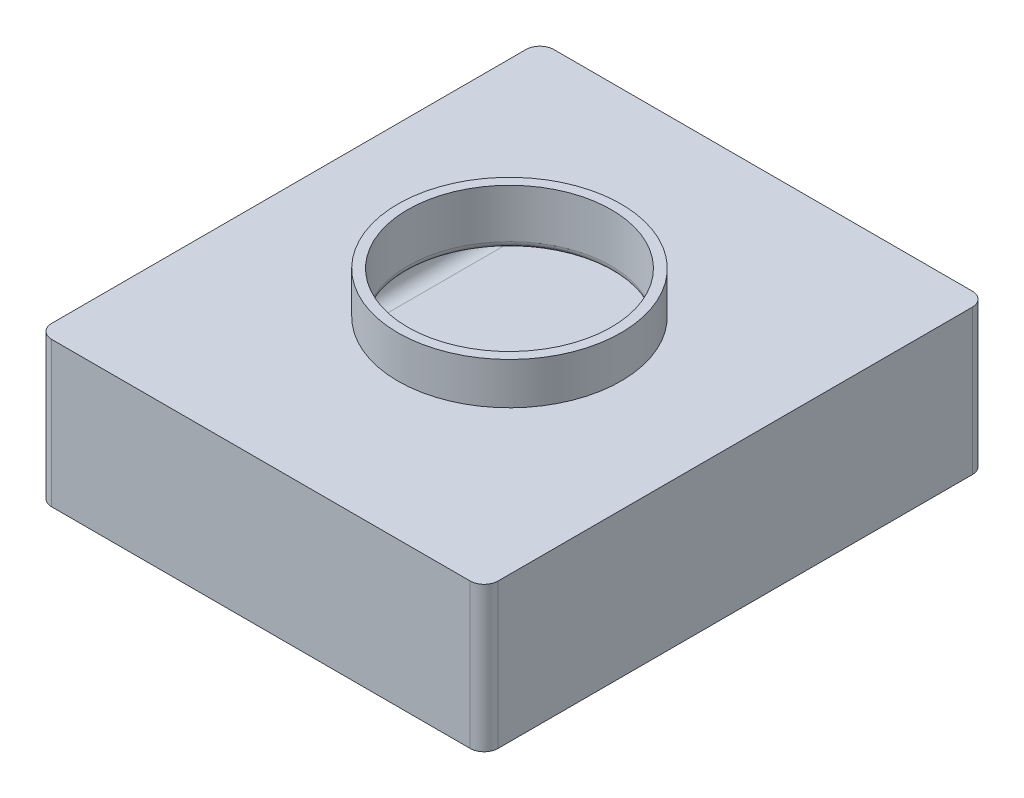
ISO-10303-21;
HEADER;
FILE_DESCRIPTION(('STEP AP214'),'2;1');
FILE_NAME('part.step','',(''),(''),'','','');
FILE_SCHEMA(('AUTOMOTIVE_DESIGN { 1 0 10303 214 1 1 1 1 }'));
ENDSEC;
DATA;
#1=APPLICATION_CONTEXT('core data for automotive mechanical design processes');
#2=APPLICATION_PROTOCOL_DEFINITION('international standard','automotive_design',2000,#1);
#3=PRODUCT_CONTEXT('',#1,'mechanical');
#4=PRODUCT('Part','Part','',(#3));
#5=PRODUCT_RELATED_PRODUCT_CATEGORY('part','',(#4));
#6=PRODUCT_DEFINITION_FORMATION('','',#4);
#7=PRODUCT_DEFINITION_CONTEXT('part definition',#1,'design');
#8=PRODUCT_DEFINITION('design','',#6,#7);
#9=PRODUCT_DEFINITION_SHAPE('','',#8);
#10=(LENGTH_UNIT() NAMED_UNIT(*) SI_UNIT(.MILLI.,.METRE.));
#11=(NAMED_UNIT(*) PLANE_ANGLE_UNIT() SI_UNIT($,.RADIAN.));
#12=(NAMED_UNIT(*) SI_UNIT($,.STERADIAN.) SOLID_ANGLE_UNIT());
#13=UNCERTAINTY_MEASURE_WITH_UNIT(LENGTH_MEASURE(1.E-05),#10,'distance_accuracy_value','');
#14=(GEOMETRIC_REPRESENTATION_CONTEXT(3) GLOBAL_UNCERTAINTY_ASSIGNED_CONTEXT((#13)) GLOBAL_UNIT_ASSIGNED_CONTEXT((#10,
#11,#12)) REPRESENTATION_CONTEXT('',''));
#15=CARTESIAN_POINT('',(0.,0.,0.));
#16=DIRECTION('',(0.,0.,1.));
#17=DIRECTION('',(1.,0.,0.));
#18=AXIS2_PLACEMENT_3D('',#15,#16,#17);
#19=CARTESIAN_POINT('',(-54.4628463476071,-6.351,-14.70612001765));
#20=DIRECTION('',(0.,1.,0.));
#21=DIRECTION('',(0.,0.,1.));
#22=AXIS2_PLACEMENT_3D('',#19,#20,#21);
#23=CYLINDRICAL_SURFACE('',#22,46.355);
#24=CARTESIAN_POINT('',(-54.4628463476071,56.515,-14.70612001765));
#25=DIRECTION('',(0.,1.,0.));
#26=DIRECTION('',(0.,0.,1.));
#27=AXIS2_PLACEMENT_3D('',#24,#25,#26);
#28=CIRCLE('',#27,46.355);
#29=CARTESIAN_POINT('',(-54.4628463476071,56.515,31.64887998235));
#30=VERTEX_POINT('',#29);
#31=EDGE_CURVE('E44',#30,#30,#28,.F.);
#32=ORIENTED_EDGE('',*,*,#31,.T.);
#33=EDGE_LOOP('',(#32));
#34=FACE_BOUND('',#33,.T.);
#35=CARTESIAN_POINT('',(-54.4628463476071,78.74,-14.70612001765));
#36=DIRECTION('',(0.,1.,0.));
#37=DIRECTION('',(0.,0.,1.));
#38=AXIS2_PLACEMENT_3D('',#35,#36,#37);
#39=CIRCLE('',#38,46.355);
#40=CARTESIAN_POINT('',(-54.4628463476071,78.74,31.64887998235));
#41=VERTEX_POINT('',#40);
#42=EDGE_CURVE('E822',#41,#41,#39,.T.);
#43=ORIENTED_EDGE('',*,*,#42,.T.);
#44=EDGE_LOOP('',(#43));
#45=FACE_BOUND('',#44,.T.);
#46=ADVANCED_FACE('F36',(#34,#45),#23,.F.);
#47=CARTESIAN_POINT('',(0.,0.,0.));
#48=DIRECTION('',(0.,-1.,0.));
#49=DIRECTION('',(0.,0.,-1.));
#50=AXIS2_PLACEMENT_3D('',#47,#48,#49);
#51=PLANE('',#50);
#52=DIRECTION('',(0.,0.,-1.));
#53=VECTOR('',#52,1.);
#54=CARTESIAN_POINT('',(34.4371536523929,0.,0.));
#55=LINE('',#54,#53);
#56=CARTESIAN_POINT('',(34.4371536523929,0.,85.7471161395949));
#57=VERTEX_POINT('',#56);
#58=CARTESIAN_POINT('',(34.4371536523929,0.,-117.452883860405));
#59=VERTEX_POINT('',#58);
#60=EDGE_CURVE('E270',#57,#59,#55,.T.);
#61=ORIENTED_EDGE('',*,*,#60,.T.);
#62=DIRECTION('',(-1.,0.,0.));
#63=VECTOR('',#62,1.);
#64=CARTESIAN_POINT('',(0.,0.,-117.452883860405));
#65=LINE('',#64,#63);
#66=CARTESIAN_POINT('',(-143.362846347607,0.,-117.452883860405));
#67=VERTEX_POINT('',#66);
#68=EDGE_CURVE('E276',#59,#67,#65,.T.);
#69=ORIENTED_EDGE('',*,*,#68,.T.);
#70=DIRECTION('',(0.,0.,1.));
#71=VECTOR('',#70,1.);
#72=CARTESIAN_POINT('',(-143.362846347607,0.,0.));
#73=LINE('',#72,#71);
#74=CARTESIAN_POINT('',(-143.362846347607,0.,85.7471161395949));
#75=VERTEX_POINT('',#74);
#76=EDGE_CURVE('E274',#67,#75,#73,.T.);
#77=ORIENTED_EDGE('',*,*,#76,.T.);
#78=DIRECTION('',(1.,0.,0.));
#79=VECTOR('',#78,1.);
#80=CARTESIAN_POINT('',(0.,0.,85.7471161395949));
#81=LINE('',#80,#79);
#82=EDGE_CURVE('E272',#75,#57,#81,.T.);
#83=ORIENTED_EDGE('',*,*,#82,.T.);
#84=EDGE_LOOP('',(#61,#69,#77,#83));
#85=FACE_BOUND('',#84,.T.);
#86=ADVANCED_FACE('F368',(#85),#51,.F.);
#87=CARTESIAN_POINT('',(40.7871536523929,53.34,-123.802883860405));
#88=DIRECTION('',(-1.,0.,0.));
#89=DIRECTION('',(0.,0.,1.));
#90=AXIS2_PLACEMENT_3D('',#87,#88,#89);
#91=PLANE('',#90);
#92=DIRECTION('',(0.,0.,-1.));
#93=VECTOR('',#92,1.);
#94=CARTESIAN_POINT('',(40.7871536523929,6.35,-123.802883860405));
#95=LINE('',#94,#93);
#96=CARTESIAN_POINT('',(40.7871536523929,6.35,-117.452883860405));
#97=VERTEX_POINT('',#96);
#98=CARTESIAN_POINT('',(40.7871536523929,6.35,85.7471161395949));
#99=VERTEX_POINT('',#98);
#100=EDGE_CURVE('E252',#97,#99,#95,.F.);
#101=ORIENTED_EDGE('',*,*,#100,.T.);
#102=DIRECTION('',(0.,-1.,0.));
#103=VECTOR('',#102,1.);
#104=CARTESIAN_POINT('',(40.7871536523929,53.34,85.7471161395949));
#105=LINE('',#104,#103);
#106=CARTESIAN_POINT('',(40.7871536523929,46.99,85.7471161395949));
#107=VERTEX_POINT('',#106);
#108=EDGE_CURVE('E258',#99,#107,#105,.F.);
#109=ORIENTED_EDGE('',*,*,#108,.T.);
#110=DIRECTION('',(0.,0.,-1.));
#111=VECTOR('',#110,1.);
#112=CARTESIAN_POINT('',(40.7871536523929,46.99,-123.802883860405));
#113=LINE('',#112,#111);
#114=CARTESIAN_POINT('',(40.7871536523929,46.99,-117.452883860405));
#115=VERTEX_POINT('',#114);
#116=EDGE_CURVE('E256',#107,#115,#113,.T.);
#117=ORIENTED_EDGE('',*,*,#116,.T.);
#118=DIRECTION('',(0.,-1.,0.));
#119=VECTOR('',#118,1.);
#120=CARTESIAN_POINT('',(40.7871536523929,0.,-117.452883860405));
#121=LINE('',#120,#119);
#122=EDGE_CURVE('E254',#115,#97,#121,.T.);
#123=ORIENTED_EDGE('',*,*,#122,.T.);
#124=EDGE_LOOP('',(#101,#109,#117,#123));
#125=FACE_BOUND('',#124,.T.);
#126=ADVANCED_FACE('F373',(#125),#91,.T.);
#127=CARTESIAN_POINT('',(-149.712846347607,53.34,-123.802883860405));
#128=DIRECTION('',(0.,0.,1.));
#129=DIRECTION('',(1.,0.,0.));
#130=AXIS2_PLACEMENT_3D('',#127,#128,#129);
#131=PLANE('',#130);
#132=DIRECTION('',(-1.,0.,0.));
#133=VECTOR('',#132,1.);
#134=CARTESIAN_POINT('',(-149.712846347607,6.35,-123.802883860405));
#135=LINE('',#134,#133);
#136=CARTESIAN_POINT('',(-143.362846347607,6.35,-123.802883860405));
#137=VERTEX_POINT('',#136);
#138=CARTESIAN_POINT('',(34.4371536523929,6.35,-123.802883860405));
#139=VERTEX_POINT('',#138);
#140=EDGE_CURVE('E263',#137,#139,#135,.F.);
#141=ORIENTED_EDGE('',*,*,#140,.T.);
#142=DIRECTION('',(0.,-1.,0.));
#143=VECTOR('',#142,1.);
#144=CARTESIAN_POINT('',(34.4371536523929,53.34,-123.802883860405));
#145=LINE('',#144,#143);
#146=CARTESIAN_POINT('',(34.4371536523929,46.99,-123.802883860405));
#147=VERTEX_POINT('',#146);
#148=EDGE_CURVE('E267',#139,#147,#145,.F.);
#149=ORIENTED_EDGE('',*,*,#148,.T.);
#150=DIRECTION('',(-1.,0.,0.));
#151=VECTOR('',#150,1.);
#152=CARTESIAN_POINT('',(-149.712846347607,46.99,-123.802883860405));
#153=LINE('',#152,#151);
#154=CARTESIAN_POINT('',(-143.362846347607,46.99,-123.802883860405));
#155=VERTEX_POINT('',#154);
#156=EDGE_CURVE('E265',#147,#155,#153,.T.);
#157=ORIENTED_EDGE('',*,*,#156,.T.);
#158=DIRECTION('',(0.,-1.,0.));
#159=VECTOR('',#158,1.);
#160=CARTESIAN_POINT('',(-143.362846347607,0.,-123.802883860405));
#161=LINE('',#160,#159);
#162=EDGE_CURVE('E261',#155,#137,#161,.T.);
#163=ORIENTED_EDGE('',*,*,#162,.T.);
#164=EDGE_LOOP('',(#141,#149,#157,#163));
#165=FACE_BOUND('',#164,.T.);
#166=ADVANCED_FACE('F389',(#165),#131,.T.);
#167=CARTESIAN_POINT('',(-149.712846347607,53.34,-123.802883860405));
#168=DIRECTION('',(1.,0.,0.));
#169=DIRECTION('',(0.,0.,-1.));
#170=AXIS2_PLACEMENT_3D('',#167,#168,#169);
#171=PLANE('',#170);
#172=DIRECTION('',(0.,0.,1.));
#173=VECTOR('',#172,1.);
#174=CARTESIAN_POINT('',(-149.712846347607,46.99,-123.802883860405));
#175=LINE('',#174,#173);
#176=CARTESIAN_POINT('',(-149.712846347607,46.99,-117.452883860405));
#177=VERTEX_POINT('',#176);
#178=CARTESIAN_POINT('',(-149.712846347607,46.99,85.7471161395949));
#179=VERTEX_POINT('',#178);
#180=EDGE_CURVE('E283',#177,#179,#175,.T.);
#181=ORIENTED_EDGE('',*,*,#180,.T.);
#182=DIRECTION('',(0.,-1.,0.));
#183=VECTOR('',#182,1.);
#184=CARTESIAN_POINT('',(-149.712846347607,0.,85.7471161395949));
#185=LINE('',#184,#183);
#186=CARTESIAN_POINT('',(-149.712846347607,6.35,85.7471161395949));
#187=VERTEX_POINT('',#186);
#188=EDGE_CURVE('E59',#179,#187,#185,.T.);
#189=ORIENTED_EDGE('',*,*,#188,.T.);
#190=DIRECTION('',(0.,0.,1.));
#191=VECTOR('',#190,1.);
#192=CARTESIAN_POINT('',(-149.712846347607,6.35,-123.802883860405));
#193=LINE('',#192,#191);
#194=CARTESIAN_POINT('',(-149.712846347607,6.35,-117.452883860405));
#195=VERTEX_POINT('',#194);
#196=EDGE_CURVE('E281',#187,#195,#193,.F.);
#197=ORIENTED_EDGE('',*,*,#196,.T.);
#198=DIRECTION('',(0.,-1.,0.));
#199=VECTOR('',#198,1.);
#200=CARTESIAN_POINT('',(-149.712846347607,53.34,-117.452883860405));
#201=LINE('',#200,#199);
#202=EDGE_CURVE('E279',#195,#177,#201,.F.);
#203=ORIENTED_EDGE('',*,*,#202,.T.);
#204=EDGE_LOOP('',(#181,#189,#197,#203));
#205=FACE_BOUND('',#204,.T.);
#206=ADVANCED_FACE('F392',(#205),#171,.T.);
#207=CARTESIAN_POINT('',(-149.712846347607,53.34,92.0971161395949));
#208=DIRECTION('',(0.,0.,-1.));
#209=DIRECTION('',(-1.,0.,0.));
#210=AXIS2_PLACEMENT_3D('',#207,#208,#209);
#211=PLANE('',#210);
#212=DIRECTION('',(0.,-1.,0.));
#213=VECTOR('',#212,1.);
#214=CARTESIAN_POINT('',(-143.362846347607,53.34,92.0971161395949));
#215=LINE('',#214,#213);
#216=CARTESIAN_POINT('',(-143.362846347607,6.35,92.0971161395949));
#217=VERTEX_POINT('',#216);
#218=CARTESIAN_POINT('',(-143.362846347607,46.99,92.0971161395949));
#219=VERTEX_POINT('',#218);
#220=EDGE_CURVE('E234',#217,#219,#215,.F.);
#221=ORIENTED_EDGE('',*,*,#220,.T.);
#222=DIRECTION('',(1.,0.,0.));
#223=VECTOR('',#222,1.);
#224=CARTESIAN_POINT('',(-149.712846347607,46.99,92.0971161395949));
#225=LINE('',#224,#223);
#226=CARTESIAN_POINT('',(34.4371536523929,46.99,92.0971161395949));
#227=VERTEX_POINT('',#226);
#228=EDGE_CURVE('E240',#219,#227,#225,.T.);
#229=ORIENTED_EDGE('',*,*,#228,.T.);
#230=DIRECTION('',(0.,-1.,0.));
#231=VECTOR('',#230,1.);
#232=CARTESIAN_POINT('',(34.4371536523929,0.,92.0971161395949));
#233=LINE('',#232,#231);
#234=CARTESIAN_POINT('',(34.4371536523929,6.35,92.0971161395949));
#235=VERTEX_POINT('',#234);
#236=EDGE_CURVE('E238',#227,#235,#233,.T.);
#237=ORIENTED_EDGE('',*,*,#236,.T.);
#238=DIRECTION('',(1.,0.,0.));
#239=VECTOR('',#238,1.);
#240=CARTESIAN_POINT('',(-149.712846347607,6.35,92.0971161395949));
#241=LINE('',#240,#239);
#242=EDGE_CURVE('E236',#235,#217,#241,.F.);
#243=ORIENTED_EDGE('',*,*,#242,.T.);
#244=EDGE_LOOP('',(#221,#229,#237,#243));
#245=FACE_BOUND('',#244,.T.);
#246=ADVANCED_FACE('F384',(#245),#211,.T.);
#247=CARTESIAN_POINT('',(0.,53.34,0.));
#248=DIRECTION('',(0.,1.,0.));
#249=DIRECTION('',(0.,0.,1.));
#250=AXIS2_PLACEMENT_3D('',#247,#248,#249);
#251=PLANE('',#250);
#252=CARTESIAN_POINT('',(-54.4628463476071,53.34,-14.70612001765));
#253=DIRECTION('',(0.,1.,0.));
#254=DIRECTION('',(0.,0.,1.));
#255=AXIS2_PLACEMENT_3D('',#252,#253,#254);
#256=CIRCLE('',#255,49.53);
#257=CARTESIAN_POINT('',(-54.4628463476071,53.34,34.82387998235));
#258=VERTEX_POINT('',#257);
#259=EDGE_CURVE('E11',#258,#258,#256,.T.);
#260=ORIENTED_EDGE('',*,*,#259,.T.);
#261=EDGE_LOOP('',(#260));
#262=FACE_BOUND('',#261,.T.);
#263=DIRECTION('',(0.,0.,-1.));
#264=VECTOR('',#263,1.);
#265=CARTESIAN_POINT('',(34.4371536523929,53.34,0.));
#266=LINE('',#265,#264);
#267=CARTESIAN_POINT('',(34.4371536523929,53.34,-117.452883860405));
#268=VERTEX_POINT('',#267);
#269=CARTESIAN_POINT('',(34.4371536523929,53.34,85.7471161395949));
#270=VERTEX_POINT('',#269);
#271=EDGE_CURVE('E247',#268,#270,#266,.F.);
#272=ORIENTED_EDGE('',*,*,#271,.T.);
#273=DIRECTION('',(1.,0.,0.));
#274=VECTOR('',#273,1.);
#275=CARTESIAN_POINT('',(0.,53.34,85.7471161395949));
#276=LINE('',#275,#274);
#277=CARTESIAN_POINT('',(-143.362846347607,53.34,85.7471161395949));
#278=VERTEX_POINT('',#277);
#279=EDGE_CURVE('E249',#270,#278,#276,.F.);
#280=ORIENTED_EDGE('',*,*,#279,.T.);
#281=DIRECTION('',(0.,0.,1.));
#282=VECTOR('',#281,1.);
#283=CARTESIAN_POINT('',(-143.362846347607,53.34,0.));
#284=LINE('',#283,#282);
#285=CARTESIAN_POINT('',(-143.362846347607,53.34,-117.452883860405));
#286=VERTEX_POINT('',#285);
#287=EDGE_CURVE('E243',#278,#286,#284,.F.);
#288=ORIENTED_EDGE('',*,*,#287,.T.);
#289=DIRECTION('',(-1.,0.,0.));
#290=VECTOR('',#289,1.);
#291=CARTESIAN_POINT('',(0.,53.34,-117.452883860405));
#292=LINE('',#291,#290);
#293=EDGE_CURVE('E245',#286,#268,#292,.F.);
#294=ORIENTED_EDGE('',*,*,#293,.T.);
#295=EDGE_LOOP('',(#272,#280,#288,#294));
#296=FACE_BOUND('',#295,.T.);
#297=ADVANCED_FACE('F380',(#262,#296),#251,.F.);
#298=CARTESIAN_POINT('',(0.,6.35,-117.452883860405));
#299=DIRECTION('',(-1.,0.,0.));
#300=DIRECTION('',(0.,0.,1.));
#301=AXIS2_PLACEMENT_3D('',#298,#299,#300);
#302=CYLINDRICAL_SURFACE('',#301,6.35);
#303=CARTESIAN_POINT('',(-143.362846347607,6.35,-117.452883860405));
#304=DIRECTION('',(1.,0.,0.));
#305=DIRECTION('',(0.,0.,-1.));
#306=AXIS2_PLACEMENT_3D('',#303,#304,#305);
#307=CIRCLE('',#306,6.35);
#308=EDGE_CURVE('E349',#67,#137,#307,.T.);
#309=ORIENTED_EDGE('',*,*,#308,.F.);
#310=ORIENTED_EDGE('',*,*,#68,.F.);
#311=CARTESIAN_POINT('',(34.4371536523929,6.35,-117.452883860405));
#312=DIRECTION('',(-1.,0.,0.));
#313=DIRECTION('',(0.,0.,1.));
#314=AXIS2_PLACEMENT_3D('',#311,#312,#313);
#315=CIRCLE('',#314,6.35);
#316=EDGE_CURVE('E346',#139,#59,#315,.T.);
#317=ORIENTED_EDGE('',*,*,#316,.F.);
#318=ORIENTED_EDGE('',*,*,#140,.F.);
#319=EDGE_LOOP('',(#309,#310,#317,#318));
#320=FACE_BOUND('',#319,.T.);
#321=ADVANCED_FACE('F383',(#320),#302,.F.);
#322=CARTESIAN_POINT('',(-143.362846347607,6.35,-117.452883860405));
#323=DIRECTION('',(0.,0.,1.));
#324=DIRECTION('',(1.,0.,0.));
#325=AXIS2_PLACEMENT_3D('',#322,#323,#324);
#326=SPHERICAL_SURFACE('',#325,6.35);
#327=CARTESIAN_POINT('',(-143.362846347607,6.35,-117.452883860405));
#328=DIRECTION('',(0.,0.,1.));
#329=DIRECTION('',(1.,0.,0.));
#330=AXIS2_PLACEMENT_3D('',#327,#328,#329);
#331=CIRCLE('',#330,6.35);
#332=EDGE_CURVE('E340',#67,#195,#331,.F.);
#333=ORIENTED_EDGE('',*,*,#332,.F.);
#334=ORIENTED_EDGE('',*,*,#308,.T.);
#335=CARTESIAN_POINT('',(-143.362846347607,6.35,-117.452883860405));
#336=DIRECTION('',(0.,1.,0.));
#337=DIRECTION('',(0.,0.,1.));
#338=AXIS2_PLACEMENT_3D('',#335,#336,#337);
#339=CIRCLE('',#338,6.35);
#340=EDGE_CURVE('E343',#195,#137,#339,.F.);
#341=ORIENTED_EDGE('',*,*,#340,.F.);
#342=EDGE_LOOP('',(#333,#334,#341));
#343=FACE_BOUND('',#342,.T.);
#344=ADVANCED_FACE('F499',(#343),#326,.F.);
#345=CARTESIAN_POINT('',(34.4371536523929,6.35,-117.452883860405));
#346=DIRECTION('',(0.,0.,1.));
#347=DIRECTION('',(1.,0.,0.));
#348=AXIS2_PLACEMENT_3D('',#345,#346,#347);
#349=SPHERICAL_SURFACE('',#348,6.35);
#350=CARTESIAN_POINT('',(34.4371536523929,6.35,-117.452883860405));
#351=DIRECTION('',(0.,1.,0.));
#352=DIRECTION('',(0.,0.,1.));
#353=AXIS2_PLACEMENT_3D('',#350,#351,#352);
#354=CIRCLE('',#353,6.35);
#355=EDGE_CURVE('E334',#139,#97,#354,.F.);
#356=ORIENTED_EDGE('',*,*,#355,.F.);
#357=ORIENTED_EDGE('',*,*,#316,.T.);
#358=CARTESIAN_POINT('',(34.4371536523929,6.35,-117.452883860405));
#359=DIRECTION('',(0.,0.,1.));
#360=DIRECTION('',(1.,0.,0.));
#361=AXIS2_PLACEMENT_3D('',#358,#359,#360);
#362=CIRCLE('',#361,6.35);
#363=EDGE_CURVE('E337',#97,#59,#362,.F.);
#364=ORIENTED_EDGE('',*,*,#363,.F.);
#365=EDGE_LOOP('',(#356,#357,#364));
#366=FACE_BOUND('',#365,.T.);
#367=ADVANCED_FACE('F495',(#366),#349,.F.);
#368=CARTESIAN_POINT('',(-143.362846347607,53.34,-117.452883860405));
#369=DIRECTION('',(0.,1.,0.));
#370=DIRECTION('',(0.,0.,1.));
#371=AXIS2_PLACEMENT_3D('',#368,#369,#370);
#372=CYLINDRICAL_SURFACE('',#371,6.35);
#373=ORIENTED_EDGE('',*,*,#340,.T.);
#374=ORIENTED_EDGE('',*,*,#162,.F.);
#375=CARTESIAN_POINT('',(-143.362846347607,46.99,-117.452883860405));
#376=DIRECTION('',(0.,-1.,0.));
#377=DIRECTION('',(0.,0.,-1.));
#378=AXIS2_PLACEMENT_3D('',#375,#376,#377);
#379=CIRCLE('',#378,6.35);
#380=EDGE_CURVE('E328',#177,#155,#379,.T.);
#381=ORIENTED_EDGE('',*,*,#380,.F.);
#382=ORIENTED_EDGE('',*,*,#202,.F.);
#383=EDGE_LOOP('',(#373,#374,#381,#382));
#384=FACE_BOUND('',#383,.T.);
#385=ADVANCED_FACE('F491',(#384),#372,.F.);
#386=CARTESIAN_POINT('',(-143.362846347607,6.35,0.));
#387=DIRECTION('',(0.,0.,1.));
#388=DIRECTION('',(1.,0.,0.));
#389=AXIS2_PLACEMENT_3D('',#386,#387,#388);
#390=CYLINDRICAL_SURFACE('',#389,6.35);
#391=ORIENTED_EDGE('',*,*,#332,.T.);
#392=ORIENTED_EDGE('',*,*,#196,.F.);
#393=CARTESIAN_POINT('',(-143.362846347607,6.35,85.7471161395949));
#394=DIRECTION('',(0.,0.,-1.));
#395=DIRECTION('',(-1.,0.,0.));
#396=AXIS2_PLACEMENT_3D('',#393,#394,#395);
#397=CIRCLE('',#396,6.35);
#398=EDGE_CURVE('E325',#75,#187,#397,.T.);
#399=ORIENTED_EDGE('',*,*,#398,.F.);
#400=ORIENTED_EDGE('',*,*,#76,.F.);
#401=EDGE_LOOP('',(#391,#392,#399,#400));
#402=FACE_BOUND('',#401,.T.);
#403=ADVANCED_FACE('F487',(#402),#390,.F.);
#404=CARTESIAN_POINT('',(0.,6.35,85.7471161395949));
#405=DIRECTION('',(1.,0.,0.));
#406=DIRECTION('',(0.,0.,-1.));
#407=AXIS2_PLACEMENT_3D('',#404,#405,#406);
#408=CYLINDRICAL_SURFACE('',#407,6.35);
#409=CARTESIAN_POINT('',(34.4371536523929,6.35,85.7471161395949));
#410=DIRECTION('',(-1.,0.,0.));
#411=DIRECTION('',(0.,0.,1.));
#412=AXIS2_PLACEMENT_3D('',#409,#410,#411);
#413=CIRCLE('',#412,6.35);
#414=EDGE_CURVE('E319',#57,#235,#413,.T.);
#415=ORIENTED_EDGE('',*,*,#414,.F.);
#416=ORIENTED_EDGE('',*,*,#82,.F.);
#417=CARTESIAN_POINT('',(-143.362846347607,6.35,85.7471161395949));
#418=DIRECTION('',(1.,0.,0.));
#419=DIRECTION('',(0.,0.,-1.));
#420=AXIS2_PLACEMENT_3D('',#417,#418,#419);
#421=CIRCLE('',#420,6.35);
#422=EDGE_CURVE('E322',#217,#75,#421,.T.);
#423=ORIENTED_EDGE('',*,*,#422,.F.);
#424=ORIENTED_EDGE('',*,*,#242,.F.);
#425=EDGE_LOOP('',(#415,#416,#423,#424));
#426=FACE_BOUND('',#425,.T.);
#427=ADVANCED_FACE('F483',(#426),#408,.F.);
#428=CARTESIAN_POINT('',(34.4371536523929,6.35,0.));
#429=DIRECTION('',(0.,0.,-1.));
#430=DIRECTION('',(-1.,0.,0.));
#431=AXIS2_PLACEMENT_3D('',#428,#429,#430);
#432=CYLINDRICAL_SURFACE('',#431,6.35);
#433=ORIENTED_EDGE('',*,*,#363,.T.);
#434=ORIENTED_EDGE('',*,*,#60,.F.);
#435=CARTESIAN_POINT('',(34.4371536523929,6.35,85.7471161395949));
#436=DIRECTION('',(0.,0.,-1.));
#437=DIRECTION('',(-1.,0.,0.));
#438=AXIS2_PLACEMENT_3D('',#435,#436,#437);
#439=CIRCLE('',#438,6.35);
#440=EDGE_CURVE('E316',#99,#57,#439,.T.);
#441=ORIENTED_EDGE('',*,*,#440,.F.);
#442=ORIENTED_EDGE('',*,*,#100,.F.);
#443=EDGE_LOOP('',(#433,#434,#441,#442));
#444=FACE_BOUND('',#443,.T.);
#445=ADVANCED_FACE('F479',(#444),#432,.F.);
#446=CARTESIAN_POINT('',(34.4371536523929,53.34,-117.452883860405));
#447=DIRECTION('',(0.,1.,0.));
#448=DIRECTION('',(0.,0.,1.));
#449=AXIS2_PLACEMENT_3D('',#446,#447,#448);
#450=CYLINDRICAL_SURFACE('',#449,6.35);
#451=ORIENTED_EDGE('',*,*,#355,.T.);
#452=ORIENTED_EDGE('',*,*,#122,.F.);
#453=CARTESIAN_POINT('',(34.4371536523929,46.99,-117.452883860405));
#454=DIRECTION('',(0.,-1.,0.));
#455=DIRECTION('',(0.,0.,-1.));
#456=AXIS2_PLACEMENT_3D('',#453,#454,#455);
#457=CIRCLE('',#456,6.35);
#458=EDGE_CURVE('E313',#147,#115,#457,.T.);
#459=ORIENTED_EDGE('',*,*,#458,.F.);
#460=ORIENTED_EDGE('',*,*,#148,.F.);
#461=EDGE_LOOP('',(#451,#452,#459,#460));
#462=FACE_BOUND('',#461,.T.);
#463=ADVANCED_FACE('F475',(#462),#450,.F.);
#464=CARTESIAN_POINT('',(-149.712846347607,46.99,-117.452883860405));
#465=DIRECTION('',(-1.,0.,0.));
#466=DIRECTION('',(0.,0.,1.));
#467=AXIS2_PLACEMENT_3D('',#464,#465,#466);
#468=CYLINDRICAL_SURFACE('',#467,6.35);
#469=CARTESIAN_POINT('',(-143.362846347607,46.99,-117.452883860405));
#470=DIRECTION('',(1.,0.,0.));
#471=DIRECTION('',(0.,0.,-1.));
#472=AXIS2_PLACEMENT_3D('',#469,#470,#471);
#473=CIRCLE('',#472,6.35);
#474=EDGE_CURVE('E331',#155,#286,#473,.T.);
#475=ORIENTED_EDGE('',*,*,#474,.F.);
#476=ORIENTED_EDGE('',*,*,#156,.F.);
#477=CARTESIAN_POINT('',(34.4371536523929,46.99,-117.452883860405));
#478=DIRECTION('',(-1.,0.,0.));
#479=DIRECTION('',(0.,0.,1.));
#480=AXIS2_PLACEMENT_3D('',#477,#478,#479);
#481=CIRCLE('',#480,6.35);
#482=EDGE_CURVE('E311',#268,#147,#481,.T.);
#483=ORIENTED_EDGE('',*,*,#482,.F.);
#484=ORIENTED_EDGE('',*,*,#293,.F.);
#485=EDGE_LOOP('',(#475,#476,#483,#484));
#486=FACE_BOUND('',#485,.T.);
#487=ADVANCED_FACE('F471',(#486),#468,.F.);
#488=CARTESIAN_POINT('',(-143.362846347607,46.99,-117.452883860405));
#489=DIRECTION('',(0.,0.,1.));
#490=DIRECTION('',(1.,0.,0.));
#491=AXIS2_PLACEMENT_3D('',#488,#489,#490);
#492=SPHERICAL_SURFACE('',#491,6.35);
#493=ORIENTED_EDGE('',*,*,#380,.T.);
#494=ORIENTED_EDGE('',*,*,#474,.T.);
#495=CARTESIAN_POINT('',(-143.362846347607,46.99,-117.452883860405));
#496=DIRECTION('',(0.,0.,1.));
#497=DIRECTION('',(1.,0.,0.));
#498=AXIS2_PLACEMENT_3D('',#495,#496,#497);
#499=CIRCLE('',#498,6.35);
#500=EDGE_CURVE('E308',#177,#286,#499,.F.);
#501=ORIENTED_EDGE('',*,*,#500,.F.);
#502=EDGE_LOOP('',(#493,#494,#501));
#503=FACE_BOUND('',#502,.T.);
#504=ADVANCED_FACE('F467',(#503),#492,.F.);
#505=CARTESIAN_POINT('',(-143.362846347607,6.35,85.7471161395949));
#506=DIRECTION('',(0.,0.,1.));
#507=DIRECTION('',(1.,0.,0.));
#508=AXIS2_PLACEMENT_3D('',#505,#506,#507);
#509=SPHERICAL_SURFACE('',#508,6.35);
#510=ORIENTED_EDGE('',*,*,#422,.T.);
#511=ORIENTED_EDGE('',*,*,#398,.T.);
#512=CARTESIAN_POINT('',(-143.362846347607,6.35,85.7471161395949));
#513=DIRECTION('',(0.,1.,0.));
#514=DIRECTION('',(0.,0.,1.));
#515=AXIS2_PLACEMENT_3D('',#512,#513,#514);
#516=CIRCLE('',#515,6.35);
#517=EDGE_CURVE('E305',#217,#187,#516,.F.);
#518=ORIENTED_EDGE('',*,*,#517,.F.);
#519=EDGE_LOOP('',(#510,#511,#518));
#520=FACE_BOUND('',#519,.T.);
#521=ADVANCED_FACE('F463',(#520),#509,.F.);
#522=CARTESIAN_POINT('',(34.4371536523929,6.35,85.7471161395949));
#523=DIRECTION('',(0.,0.,1.));
#524=DIRECTION('',(1.,0.,0.));
#525=AXIS2_PLACEMENT_3D('',#522,#523,#524);
#526=SPHERICAL_SURFACE('',#525,6.35);
#527=ORIENTED_EDGE('',*,*,#440,.T.);
#528=ORIENTED_EDGE('',*,*,#414,.T.);
#529=CARTESIAN_POINT('',(34.4371536523929,6.35,85.7471161395949));
#530=DIRECTION('',(0.,1.,0.));
#531=DIRECTION('',(0.,0.,1.));
#532=AXIS2_PLACEMENT_3D('',#529,#530,#531);
#533=CIRCLE('',#532,6.35);
#534=EDGE_CURVE('E302',#99,#235,#533,.F.);
#535=ORIENTED_EDGE('',*,*,#534,.F.);
#536=EDGE_LOOP('',(#527,#528,#535));
#537=FACE_BOUND('',#536,.T.);
#538=ADVANCED_FACE('F459',(#537),#526,.F.);
#539=CARTESIAN_POINT('',(34.4371536523929,46.99,-117.452883860405));
#540=DIRECTION('',(0.,0.,1.));
#541=DIRECTION('',(1.,0.,0.));
#542=AXIS2_PLACEMENT_3D('',#539,#540,#541);
#543=SPHERICAL_SURFACE('',#542,6.35);
#544=ORIENTED_EDGE('',*,*,#482,.T.);
#545=ORIENTED_EDGE('',*,*,#458,.T.);
#546=CARTESIAN_POINT('',(34.4371536523929,46.99,-117.452883860405));
#547=DIRECTION('',(0.,0.,1.));
#548=DIRECTION('',(1.,0.,0.));
#549=AXIS2_PLACEMENT_3D('',#546,#547,#548);
#550=CIRCLE('',#549,6.35);
#551=EDGE_CURVE('E299',#268,#115,#550,.F.);
#552=ORIENTED_EDGE('',*,*,#551,.F.);
#553=EDGE_LOOP('',(#544,#545,#552));
#554=FACE_BOUND('',#553,.T.);
#555=ADVANCED_FACE('F455',(#554),#543,.F.);
#556=CARTESIAN_POINT('',(-143.362846347607,46.99,-123.802883860405));
#557=DIRECTION('',(0.,0.,1.));
#558=DIRECTION('',(1.,0.,0.));
#559=AXIS2_PLACEMENT_3D('',#556,#557,#558);
#560=CYLINDRICAL_SURFACE('',#559,6.35);
#561=ORIENTED_EDGE('',*,*,#500,.T.);
#562=ORIENTED_EDGE('',*,*,#287,.F.);
#563=CARTESIAN_POINT('',(-143.362846347607,46.99,85.7471161395949));
#564=DIRECTION('',(0.,0.,-1.));
#565=DIRECTION('',(-1.,0.,0.));
#566=AXIS2_PLACEMENT_3D('',#563,#564,#565);
#567=CIRCLE('',#566,6.35);
#568=EDGE_CURVE('E297',#179,#278,#567,.T.);
#569=ORIENTED_EDGE('',*,*,#568,.F.);
#570=ORIENTED_EDGE('',*,*,#180,.F.);
#571=EDGE_LOOP('',(#561,#562,#569,#570));
#572=FACE_BOUND('',#571,.T.);
#573=ADVANCED_FACE('F451',(#572),#560,.F.);
#574=CARTESIAN_POINT('',(-143.362846347607,53.34,85.7471161395949));
#575=DIRECTION('',(0.,1.,0.));
#576=DIRECTION('',(0.,0.,1.));
#577=AXIS2_PLACEMENT_3D('',#574,#575,#576);
#578=CYLINDRICAL_SURFACE('',#577,6.35);
#579=ORIENTED_EDGE('',*,*,#517,.T.);
#580=ORIENTED_EDGE('',*,*,#188,.F.);
#581=CARTESIAN_POINT('',(-143.362846347607,46.99,85.7471161395949));
#582=DIRECTION('',(0.,-1.,0.));
#583=DIRECTION('',(0.,0.,-1.));
#584=AXIS2_PLACEMENT_3D('',#581,#582,#583);
#585=CIRCLE('',#584,6.35);
#586=EDGE_CURVE('E51',#219,#179,#585,.T.);
#587=ORIENTED_EDGE('',*,*,#586,.F.);
#588=ORIENTED_EDGE('',*,*,#220,.F.);
#589=EDGE_LOOP('',(#579,#580,#587,#588));
#590=FACE_BOUND('',#589,.T.);
#591=ADVANCED_FACE('F447',(#590),#578,.F.);
#592=CARTESIAN_POINT('',(34.4371536523929,53.34,85.7471161395949));
#593=DIRECTION('',(0.,1.,0.));
#594=DIRECTION('',(0.,0.,1.));
#595=AXIS2_PLACEMENT_3D('',#592,#593,#594);
#596=CYLINDRICAL_SURFACE('',#595,6.35);
#597=ORIENTED_EDGE('',*,*,#534,.T.);
#598=ORIENTED_EDGE('',*,*,#236,.F.);
#599=CARTESIAN_POINT('',(34.4371536523929,46.99,85.7471161395949));
#600=DIRECTION('',(0.,-1.,0.));
#601=DIRECTION('',(0.,0.,-1.));
#602=AXIS2_PLACEMENT_3D('',#599,#600,#601);
#603=CIRCLE('',#602,6.35);
#604=EDGE_CURVE('E293',#107,#227,#603,.T.);
#605=ORIENTED_EDGE('',*,*,#604,.F.);
#606=ORIENTED_EDGE('',*,*,#108,.F.);
#607=EDGE_LOOP('',(#597,#598,#605,#606));
#608=FACE_BOUND('',#607,.T.);
#609=ADVANCED_FACE('F443',(#608),#596,.F.);
#610=CARTESIAN_POINT('',(34.4371536523929,46.99,-123.802883860405));
#611=DIRECTION('',(0.,0.,-1.));
#612=DIRECTION('',(-1.,0.,0.));
#613=AXIS2_PLACEMENT_3D('',#610,#611,#612);
#614=CYLINDRICAL_SURFACE('',#613,6.35);
#615=ORIENTED_EDGE('',*,*,#551,.T.);
#616=ORIENTED_EDGE('',*,*,#116,.F.);
#617=CARTESIAN_POINT('',(34.4371536523929,46.99,85.7471161395949));
#618=DIRECTION('',(0.,0.,-1.));
#619=DIRECTION('',(-1.,0.,0.));
#620=AXIS2_PLACEMENT_3D('',#617,#618,#619);
#621=CIRCLE('',#620,6.35);
#622=EDGE_CURVE('E291',#270,#107,#621,.T.);
#623=ORIENTED_EDGE('',*,*,#622,.F.);
#624=ORIENTED_EDGE('',*,*,#271,.F.);
#625=EDGE_LOOP('',(#615,#616,#623,#624));
#626=FACE_BOUND('',#625,.T.);
#627=ADVANCED_FACE('F440',(#626),#614,.F.);
#628=CARTESIAN_POINT('',(-143.362846347607,46.99,85.7471161395949));
#629=DIRECTION('',(0.,0.,1.));
#630=DIRECTION('',(1.,0.,0.));
#631=AXIS2_PLACEMENT_3D('',#628,#629,#630);
#632=SPHERICAL_SURFACE('',#631,6.35);
#633=ORIENTED_EDGE('',*,*,#586,.T.);
#634=ORIENTED_EDGE('',*,*,#568,.T.);
#635=CARTESIAN_POINT('',(-143.362846347607,46.99,85.7471161395949));
#636=DIRECTION('',(1.,0.,0.));
#637=DIRECTION('',(0.,0.,-1.));
#638=AXIS2_PLACEMENT_3D('',#635,#636,#637);
#639=CIRCLE('',#638,6.35);
#640=EDGE_CURVE('E288',#219,#278,#639,.F.);
#641=ORIENTED_EDGE('',*,*,#640,.F.);
#642=EDGE_LOOP('',(#633,#634,#641));
#643=FACE_BOUND('',#642,.T.);
#644=ADVANCED_FACE('F436',(#643),#632,.F.);
#645=CARTESIAN_POINT('',(34.4371536523929,46.99,85.7471161395949));
#646=DIRECTION('',(0.,0.,1.));
#647=DIRECTION('',(1.,0.,0.));
#648=AXIS2_PLACEMENT_3D('',#645,#646,#647);
#649=SPHERICAL_SURFACE('',#648,6.35);
#650=ORIENTED_EDGE('',*,*,#622,.T.);
#651=ORIENTED_EDGE('',*,*,#604,.T.);
#652=CARTESIAN_POINT('',(34.4371536523929,46.99,85.7471161395949));
#653=DIRECTION('',(-1.,0.,0.));
#654=DIRECTION('',(0.,-1.,0.));
#655=AXIS2_PLACEMENT_3D('',#652,#653,#654);
#656=CIRCLE('',#655,6.35);
#657=EDGE_CURVE('E286',#270,#227,#656,.F.);
#658=ORIENTED_EDGE('',*,*,#657,.F.);
#659=EDGE_LOOP('',(#650,#651,#658));
#660=FACE_BOUND('',#659,.T.);
#661=ADVANCED_FACE('F432',(#660),#649,.F.);
#662=CARTESIAN_POINT('',(-149.712846347607,46.99,85.7471161395949));
#663=DIRECTION('',(1.,0.,0.));
#664=DIRECTION('',(0.,0.,-1.));
#665=AXIS2_PLACEMENT_3D('',#662,#663,#664);
#666=CYLINDRICAL_SURFACE('',#665,6.35);
#667=ORIENTED_EDGE('',*,*,#640,.T.);
#668=ORIENTED_EDGE('',*,*,#279,.F.);
#669=ORIENTED_EDGE('',*,*,#657,.T.);
#670=ORIENTED_EDGE('',*,*,#228,.F.);
#671=EDGE_LOOP('',(#667,#668,#669,#670));
#672=FACE_BOUND('',#671,.T.);
#673=ADVANCED_FACE('F428',(#672),#666,.F.);
#674=CARTESIAN_POINT('',(-54.4628463476071,78.74,-14.70612001765));
#675=DIRECTION('',(0.,1.,0.));
#676=DIRECTION('',(0.,0.,1.));
#677=AXIS2_PLACEMENT_3D('',#674,#675,#676);
#678=PLANE('',#677);
#679=CARTESIAN_POINT('',(-54.4628463476071,78.74,-14.70612001765));
#680=DIRECTION('',(0.,1.,0.));
#681=DIRECTION('',(0.,0.,1.));
#682=AXIS2_PLACEMENT_3D('',#679,#680,#681);
#683=CIRCLE('',#682,50.8);
#684=CARTESIAN_POINT('',(-54.4628463476071,78.74,36.09387998235));
#685=VERTEX_POINT('',#684);
#686=EDGE_CURVE('E289',#685,#685,#683,.T.);
#687=ORIENTED_EDGE('',*,*,#686,.T.);
#688=EDGE_LOOP('',(#687));
#689=FACE_BOUND('',#688,.T.);
#690=ORIENTED_EDGE('',*,*,#42,.F.);
#691=EDGE_LOOP('',(#690));
#692=FACE_BOUND('',#691,.T.);
#693=ADVANCED_FACE('F431',(#689,#692),#678,.T.);
#694=CARTESIAN_POINT('',(-54.4628463476071,78.74,-14.70612001765));
#695=DIRECTION('',(0.,-1.,0.));
#696=DIRECTION('',(0.,0.,-1.));
#697=AXIS2_PLACEMENT_3D('',#694,#695,#696);
#698=CYLINDRICAL_SURFACE('',#697,50.8);
#699=ORIENTED_EDGE('',*,*,#686,.F.);
#700=EDGE_LOOP('',(#699));
#701=FACE_BOUND('',#700,.T.);
#702=CARTESIAN_POINT('',(-54.4628463476071,59.69,-14.70612001765));
#703=DIRECTION('',(0.,1.,0.));
#704=DIRECTION('',(0.,0.,1.));
#705=AXIS2_PLACEMENT_3D('',#702,#703,#704);
#706=CIRCLE('',#705,50.8);
#707=CARTESIAN_POINT('',(-54.4628463476071,59.69,36.09387998235));
#708=VERTEX_POINT('',#707);
#709=EDGE_CURVE('E820',#708,#708,#706,.T.);
#710=ORIENTED_EDGE('',*,*,#709,.T.);
#711=EDGE_LOOP('',(#710));
#712=FACE_BOUND('',#711,.T.);
#713=ADVANCED_FACE('F377',(#701,#712),#698,.T.);
#714=CARTESIAN_POINT('',(0.,-6.35,0.));
#715=DIRECTION('',(0.,-1.,0.));
#716=DIRECTION('',(0.,0.,-1.));
#717=AXIS2_PLACEMENT_3D('',#714,#715,#716);
#718=PLANE('',#717);
#719=DIRECTION('',(0.,0.,1.));
#720=VECTOR('',#719,1.);
#721=CARTESIAN_POINT('',(47.1371536523929,-6.35,-130.152883860405));
#722=LINE('',#721,#720);
#723=CARTESIAN_POINT('',(47.1371536523929,-6.35,-123.802883860405));
#724=VERTEX_POINT('',#723);
#725=CARTESIAN_POINT('',(47.1371536523929,-6.35,92.0971161395949));
#726=VERTEX_POINT('',#725);
#727=EDGE_CURVE('E179',#724,#726,#722,.T.);
#728=ORIENTED_EDGE('',*,*,#727,.T.);
#729=CARTESIAN_POINT('',(40.7871536523929,-6.35,92.0971161395949));
#730=DIRECTION('',(0.,-1.,0.));
#731=DIRECTION('',(0.,0.,-1.));
#732=AXIS2_PLACEMENT_3D('',#729,#730,#731);
#733=CIRCLE('',#732,6.35);
#734=CARTESIAN_POINT('',(40.7871536523929,-6.35,98.4471161395949));
#735=VERTEX_POINT('',#734);
#736=EDGE_CURVE('E211',#726,#735,#733,.T.);
#737=ORIENTED_EDGE('',*,*,#736,.T.);
#738=DIRECTION('',(-1.,0.,0.));
#739=VECTOR('',#738,1.);
#740=CARTESIAN_POINT('',(47.1371536523929,-6.35,98.4471161395949));
#741=LINE('',#740,#739);
#742=CARTESIAN_POINT('',(-149.712846347607,-6.35,98.4471161395949));
#743=VERTEX_POINT('',#742);
#744=EDGE_CURVE('E196',#735,#743,#741,.T.);
#745=ORIENTED_EDGE('',*,*,#744,.T.);
#746=CARTESIAN_POINT('',(-149.712846347607,-6.35,92.0971161395949));
#747=DIRECTION('',(0.,-1.,0.));
#748=DIRECTION('',(0.,0.,-1.));
#749=AXIS2_PLACEMENT_3D('',#746,#747,#748);
#750=CIRCLE('',#749,6.35);
#751=CARTESIAN_POINT('',(-156.062846347607,-6.35,92.0971161395949));
#752=VERTEX_POINT('',#751);
#753=EDGE_CURVE('E209',#743,#752,#750,.T.);
#754=ORIENTED_EDGE('',*,*,#753,.T.);
#755=DIRECTION('',(0.,0.,-1.));
#756=VECTOR('',#755,1.);
#757=CARTESIAN_POINT('',(-156.062846347607,-6.35,-130.152883860405));
#758=LINE('',#757,#756);
#759=CARTESIAN_POINT('',(-156.062846347607,-6.35,-123.802883860405));
#760=VERTEX_POINT('',#759);
#761=EDGE_CURVE('E204',#752,#760,#758,.T.);
#762=ORIENTED_EDGE('',*,*,#761,.T.);
#763=CARTESIAN_POINT('',(-149.712846347607,-6.35,-123.802883860405));
#764=DIRECTION('',(0.,-1.,0.));
#765=DIRECTION('',(0.,0.,-1.));
#766=AXIS2_PLACEMENT_3D('',#763,#764,#765);
#767=CIRCLE('',#766,6.35);
#768=CARTESIAN_POINT('',(-149.712846347607,-6.35,-130.152883860405));
#769=VERTEX_POINT('',#768);
#770=EDGE_CURVE('E186',#760,#769,#767,.T.);
#771=ORIENTED_EDGE('',*,*,#770,.T.);
#772=DIRECTION('',(1.,0.,0.));
#773=VECTOR('',#772,1.);
#774=CARTESIAN_POINT('',(47.1371536523929,-6.35,-130.152883860405));
#775=LINE('',#774,#773);
#776=CARTESIAN_POINT('',(40.7871536523929,-6.35,-130.152883860405));
#777=VERTEX_POINT('',#776);
#778=EDGE_CURVE('E181',#769,#777,#775,.T.);
#779=ORIENTED_EDGE('',*,*,#778,.T.);
#780=CARTESIAN_POINT('',(40.7871536523929,-6.35,-123.802883860405));
#781=DIRECTION('',(0.,-1.,0.));
#782=DIRECTION('',(0.,0.,-1.));
#783=AXIS2_PLACEMENT_3D('',#780,#781,#782);
#784=CIRCLE('',#783,6.35);
#785=EDGE_CURVE('E176',#777,#724,#784,.T.);
#786=ORIENTED_EDGE('',*,*,#785,.T.);
#787=EDGE_LOOP('',(#728,#737,#745,#754,#762,#771,#779,#786));
#788=FACE_BOUND('',#787,.T.);
#789=ADVANCED_FACE('F178',(#788),#718,.T.);
#790=CARTESIAN_POINT('',(-149.712846347607,53.34,92.0971161395949));
#791=DIRECTION('',(0.,-1.,0.));
#792=DIRECTION('',(0.,0.,-1.));
#793=AXIS2_PLACEMENT_3D('',#790,#791,#792);
#794=CYLINDRICAL_SURFACE('',#793,6.35);
#795=CARTESIAN_POINT('',(-149.712846347607,59.69,92.0971161395949));
#796=DIRECTION('',(0.,1.,0.));
#797=DIRECTION('',(0.,0.,1.));
#798=AXIS2_PLACEMENT_3D('',#795,#796,#797);
#799=CIRCLE('',#798,6.35);
#800=CARTESIAN_POINT('',(-156.062846347607,59.69,92.0971161395949));
#801=VERTEX_POINT('',#800);
#802=CARTESIAN_POINT('',(-149.712846347607,59.69,98.4471161395949));
#803=VERTEX_POINT('',#802);
#804=EDGE_CURVE('E221',#801,#803,#799,.T.);
#805=ORIENTED_EDGE('',*,*,#804,.F.);
#806=DIRECTION('',(0.,-1.,0.));
#807=VECTOR('',#806,1.);
#808=CARTESIAN_POINT('',(-156.062846347607,53.34,92.0971161395949));
#809=LINE('',#808,#807);
#810=EDGE_CURVE('E228',#752,#801,#809,.F.);
#811=ORIENTED_EDGE('',*,*,#810,.F.);
#812=ORIENTED_EDGE('',*,*,#753,.F.);
#813=DIRECTION('',(0.,-1.,0.));
#814=VECTOR('',#813,1.);
#815=CARTESIAN_POINT('',(-149.712846347607,53.34,98.4471161395949));
#816=LINE('',#815,#814);
#817=EDGE_CURVE('E213',#803,#743,#816,.T.);
#818=ORIENTED_EDGE('',*,*,#817,.F.);
#819=EDGE_LOOP('',(#805,#811,#812,#818));
#820=FACE_BOUND('',#819,.T.);
#821=ADVANCED_FACE('F387',(#820),#794,.T.);
#822=CARTESIAN_POINT('',(-156.062846347607,53.34,-130.152883860405));
#823=DIRECTION('',(1.,0.,0.));
#824=DIRECTION('',(0.,0.,-1.));
#825=AXIS2_PLACEMENT_3D('',#822,#823,#824);
#826=PLANE('',#825);
#827=ORIENTED_EDGE('',*,*,#761,.F.);
#828=ORIENTED_EDGE('',*,*,#810,.T.);
#829=DIRECTION('',(0.,0.,1.));
#830=VECTOR('',#829,1.);
#831=CARTESIAN_POINT('',(-156.062846347607,59.69,-130.152883860405));
#832=LINE('',#831,#830);
#833=CARTESIAN_POINT('',(-156.062846347607,59.69,-123.802883860405));
#834=VERTEX_POINT('',#833);
#835=EDGE_CURVE('E351',#834,#801,#832,.T.);
#836=ORIENTED_EDGE('',*,*,#835,.F.);
#837=DIRECTION('',(0.,-1.,0.));
#838=VECTOR('',#837,1.);
#839=CARTESIAN_POINT('',(-156.062846347607,53.34,-123.802883860405));
#840=LINE('',#839,#838);
#841=EDGE_CURVE('E225',#834,#760,#840,.T.);
#842=ORIENTED_EDGE('',*,*,#841,.T.);
#843=EDGE_LOOP('',(#827,#828,#836,#842));
#844=FACE_BOUND('',#843,.T.);
#845=ADVANCED_FACE('F413',(#844),#826,.F.);
#846=CARTESIAN_POINT('',(-149.712846347607,53.34,-123.802883860405));
#847=DIRECTION('',(0.,-1.,0.));
#848=DIRECTION('',(0.,0.,-1.));
#849=AXIS2_PLACEMENT_3D('',#846,#847,#848);
#850=CYLINDRICAL_SURFACE('',#849,6.35);
#851=CARTESIAN_POINT('',(-149.712846347607,59.69,-123.802883860405));
#852=DIRECTION('',(0.,1.,0.));
#853=DIRECTION('',(0.,0.,1.));
#854=AXIS2_PLACEMENT_3D('',#851,#852,#853);
#855=CIRCLE('',#854,6.35);
#856=CARTESIAN_POINT('',(-149.712846347607,59.69,-130.152883860405));
#857=VERTEX_POINT('',#856);
#858=EDGE_CURVE('E219',#857,#834,#855,.T.);
#859=ORIENTED_EDGE('',*,*,#858,.F.);
#860=DIRECTION('',(0.,-1.,0.));
#861=VECTOR('',#860,1.);
#862=CARTESIAN_POINT('',(-149.712846347607,53.34,-130.152883860405));
#863=LINE('',#862,#861);
#864=EDGE_CURVE('E232',#769,#857,#863,.F.);
#865=ORIENTED_EDGE('',*,*,#864,.F.);
#866=ORIENTED_EDGE('',*,*,#770,.F.);
#867=ORIENTED_EDGE('',*,*,#841,.F.);
#868=EDGE_LOOP('',(#859,#865,#866,#867));
#869=FACE_BOUND('',#868,.T.);
#870=ADVANCED_FACE('F405',(#869),#850,.T.);
#871=CARTESIAN_POINT('',(-156.062846347607,53.34,-130.152883860405));
#872=DIRECTION('',(0.,0.,1.));
#873=DIRECTION('',(1.,0.,0.));
#874=AXIS2_PLACEMENT_3D('',#871,#872,#873);
#875=PLANE('',#874);
#876=ORIENTED_EDGE('',*,*,#778,.F.);
#877=ORIENTED_EDGE('',*,*,#864,.T.);
#878=DIRECTION('',(-1.,0.,0.));
#879=VECTOR('',#878,1.);
#880=CARTESIAN_POINT('',(-156.062846347607,59.69,-130.152883860405));
#881=LINE('',#880,#879);
#882=CARTESIAN_POINT('',(40.7871536523929,59.69,-130.152883860405));
#883=VERTEX_POINT('',#882);
#884=EDGE_CURVE('E197',#883,#857,#881,.T.);
#885=ORIENTED_EDGE('',*,*,#884,.F.);
#886=DIRECTION('',(0.,-1.,0.));
#887=VECTOR('',#886,1.);
#888=CARTESIAN_POINT('',(40.7871536523929,53.34,-130.152883860405));
#889=LINE('',#888,#887);
#890=EDGE_CURVE('E230',#883,#777,#889,.T.);
#891=ORIENTED_EDGE('',*,*,#890,.T.);
#892=EDGE_LOOP('',(#876,#877,#885,#891));
#893=FACE_BOUND('',#892,.T.);
#894=ADVANCED_FACE('F402',(#893),#875,.F.);
#895=CARTESIAN_POINT('',(40.7871536523929,53.34,-123.802883860405));
#896=DIRECTION('',(0.,-1.,0.));
#897=DIRECTION('',(0.,0.,-1.));
#898=AXIS2_PLACEMENT_3D('',#895,#896,#897);
#899=CYLINDRICAL_SURFACE('',#898,6.35);
#900=CARTESIAN_POINT('',(40.7871536523929,59.69,-123.802883860405));
#901=DIRECTION('',(0.,1.,0.));
#902=DIRECTION('',(0.,0.,1.));
#903=AXIS2_PLACEMENT_3D('',#900,#901,#902);
#904=CIRCLE('',#903,6.35);
#905=CARTESIAN_POINT('',(47.1371536523929,59.69,-123.802883860405));
#906=VERTEX_POINT('',#905);
#907=EDGE_CURVE('E201',#906,#883,#904,.T.);
#908=ORIENTED_EDGE('',*,*,#907,.F.);
#909=DIRECTION('',(0.,-1.,0.));
#910=VECTOR('',#909,1.);
#911=CARTESIAN_POINT('',(47.1371536523929,53.34,-123.802883860405));
#912=LINE('',#911,#910);
#913=EDGE_CURVE('E193',#724,#906,#912,.F.);
#914=ORIENTED_EDGE('',*,*,#913,.F.);
#915=ORIENTED_EDGE('',*,*,#785,.F.);
#916=ORIENTED_EDGE('',*,*,#890,.F.);
#917=EDGE_LOOP('',(#908,#914,#915,#916));
#918=FACE_BOUND('',#917,.T.);
#919=ADVANCED_FACE('F200',(#918),#899,.T.);
#920=CARTESIAN_POINT('',(47.1371536523929,53.34,-130.152883860405));
#921=DIRECTION('',(-1.,0.,0.));
#922=DIRECTION('',(0.,0.,1.));
#923=AXIS2_PLACEMENT_3D('',#920,#921,#922);
#924=PLANE('',#923);
#925=DIRECTION('',(0.,0.,-1.));
#926=VECTOR('',#925,1.);
#927=CARTESIAN_POINT('',(47.1371536523929,59.69,-130.152883860405));
#928=LINE('',#927,#926);
#929=CARTESIAN_POINT('',(47.1371536523929,59.69,92.0971161395949));
#930=VERTEX_POINT('',#929);
#931=EDGE_CURVE('E833',#930,#906,#928,.T.);
#932=ORIENTED_EDGE('',*,*,#931,.F.);
#933=DIRECTION('',(0.,-1.,0.));
#934=VECTOR('',#933,1.);
#935=CARTESIAN_POINT('',(47.1371536523929,53.34,92.0971161395949));
#936=LINE('',#935,#934);
#937=EDGE_CURVE('E187',#930,#726,#936,.T.);
#938=ORIENTED_EDGE('',*,*,#937,.T.);
#939=ORIENTED_EDGE('',*,*,#727,.F.);
#940=ORIENTED_EDGE('',*,*,#913,.T.);
#941=EDGE_LOOP('',(#932,#938,#939,#940));
#942=FACE_BOUND('',#941,.T.);
#943=ADVANCED_FACE('F192',(#942),#924,.F.);
#944=CARTESIAN_POINT('',(40.7871536523929,53.34,92.0971161395949));
#945=DIRECTION('',(0.,-1.,0.));
#946=DIRECTION('',(0.,0.,-1.));
#947=AXIS2_PLACEMENT_3D('',#944,#945,#946);
#948=CYLINDRICAL_SURFACE('',#947,6.35);
#949=CARTESIAN_POINT('',(40.7871536523929,59.69,92.0971161395949));
#950=DIRECTION('',(0.,1.,0.));
#951=DIRECTION('',(0.,0.,1.));
#952=AXIS2_PLACEMENT_3D('',#949,#950,#951);
#953=CIRCLE('',#952,6.35);
#954=CARTESIAN_POINT('',(40.7871536523929,59.69,98.4471161395949));
#955=VERTEX_POINT('',#954);
#956=EDGE_CURVE('E223',#955,#930,#953,.T.);
#957=ORIENTED_EDGE('',*,*,#956,.F.);
#958=DIRECTION('',(0.,-1.,0.));
#959=VECTOR('',#958,1.);
#960=CARTESIAN_POINT('',(40.7871536523929,53.34,98.4471161395949));
#961=LINE('',#960,#959);
#962=EDGE_CURVE('E216',#735,#955,#961,.F.);
#963=ORIENTED_EDGE('',*,*,#962,.F.);
#964=ORIENTED_EDGE('',*,*,#736,.F.);
#965=ORIENTED_EDGE('',*,*,#937,.F.);
#966=EDGE_LOOP('',(#957,#963,#964,#965));
#967=FACE_BOUND('',#966,.T.);
#968=ADVANCED_FACE('F409',(#967),#948,.T.);
#969=CARTESIAN_POINT('',(-156.062846347607,53.34,98.4471161395949));
#970=DIRECTION('',(0.,0.,-1.));
#971=DIRECTION('',(-1.,0.,0.));
#972=AXIS2_PLACEMENT_3D('',#969,#970,#971);
#973=PLANE('',#972);
#974=ORIENTED_EDGE('',*,*,#744,.F.);
#975=ORIENTED_EDGE('',*,*,#962,.T.);
#976=DIRECTION('',(1.,0.,0.));
#977=VECTOR('',#976,1.);
#978=CARTESIAN_POINT('',(-156.062846347607,59.69,98.4471161395949));
#979=LINE('',#978,#977);
#980=EDGE_CURVE('E830',#803,#955,#979,.T.);
#981=ORIENTED_EDGE('',*,*,#980,.F.);
#982=ORIENTED_EDGE('',*,*,#817,.T.);
#983=EDGE_LOOP('',(#974,#975,#981,#982));
#984=FACE_BOUND('',#983,.T.);
#985=ADVANCED_FACE('F363',(#984),#973,.F.);
#986=CARTESIAN_POINT('',(0.,59.69,0.));
#987=DIRECTION('',(0.,1.,0.));
#988=DIRECTION('',(0.,0.,1.));
#989=AXIS2_PLACEMENT_3D('',#986,#987,#988);
#990=PLANE('',#989);
#991=ORIENTED_EDGE('',*,*,#980,.T.);
#992=ORIENTED_EDGE('',*,*,#956,.T.);
#993=ORIENTED_EDGE('',*,*,#931,.T.);
#994=ORIENTED_EDGE('',*,*,#907,.T.);
#995=ORIENTED_EDGE('',*,*,#884,.T.);
#996=ORIENTED_EDGE('',*,*,#858,.T.);
#997=ORIENTED_EDGE('',*,*,#835,.T.);
#998=ORIENTED_EDGE('',*,*,#804,.T.);
#999=EDGE_LOOP('',(#991,#992,#993,#994,#995,#996,#997,#998));
#1000=FACE_BOUND('',#999,.T.);
#1001=ORIENTED_EDGE('',*,*,#709,.F.);
#1002=EDGE_LOOP('',(#1001));
#1003=FACE_BOUND('',#1002,.T.);
#1004=ADVANCED_FACE('F358',(#1000,#1003),#990,.T.);
#1005=CARTESIAN_POINT('',(-54.4628463476071,56.515,-14.70612001765));
#1006=DIRECTION('',(0.,1.,0.));
#1007=DIRECTION('',(0.,0.,1.));
#1008=AXIS2_PLACEMENT_3D('',#1005,#1006,#1007);
#1009=TOROIDAL_SURFACE('',#1008,49.53,3.175);
#1010=ORIENTED_EDGE('',*,*,#259,.F.);
#1011=EDGE_LOOP('',(#1010));
#1012=FACE_BOUND('',#1011,.T.);
#1013=ORIENTED_EDGE('',*,*,#31,.F.);
#1014=EDGE_LOOP('',(#1013));
#1015=FACE_BOUND('',#1014,.T.);
#1016=ADVANCED_FACE('F38',(#1012,#1015),#1009,.T.);
#1017=CLOSED_SHELL('',(#46,#86,#126,#166,#206,#246,#297,#321,#344,#367,#385,#403,#427,#445,#463,
#487,#504,#521,#538,#555,#573,#591,#609,#627,#644,#661,#673,#693,#713,#789,#821,#845,#870,#894,
#919,#943,#968,#985,#1004,#1016));
#1018=MANIFOLD_SOLID_BREP('B2',#1017);
#1019=ADVANCED_BREP_SHAPE_REPRESENTATION('',(#18,#1018),#14);
#1020=SHAPE_DEFINITION_REPRESENTATION(#9,#1019);
ENDSEC;
END-ISO-10303-21;
